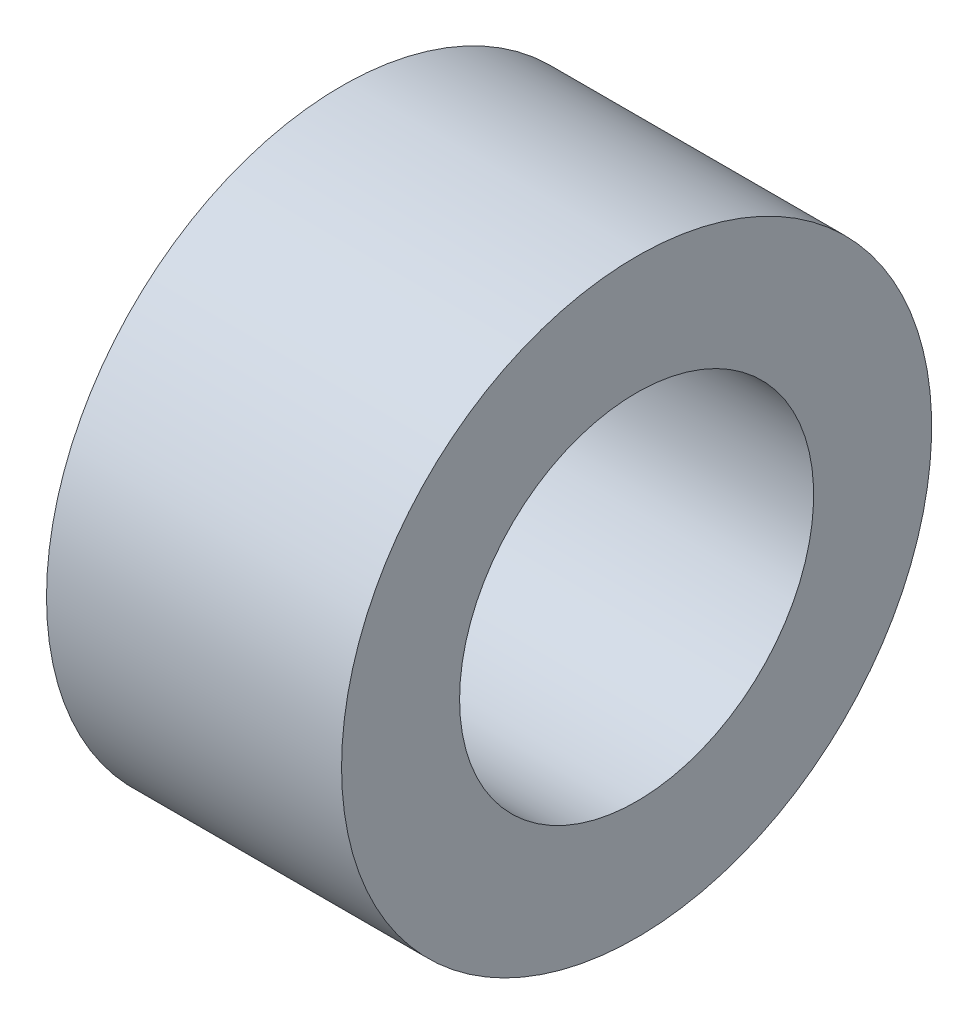
ISO-10303-21;
HEADER;
FILE_DESCRIPTION(('STEP AP214'),'2;1');
FILE_NAME('part.step','',(''),(''),'','','');
FILE_SCHEMA(('AUTOMOTIVE_DESIGN { 1 0 10303 214 1 1 1 1 }'));
ENDSEC;
DATA;
#1=APPLICATION_CONTEXT('core data for automotive mechanical design processes');
#2=APPLICATION_PROTOCOL_DEFINITION('international standard','automotive_design',2000,#1);
#3=PRODUCT_CONTEXT('',#1,'mechanical');
#4=PRODUCT('Part','Part','',(#3));
#5=PRODUCT_RELATED_PRODUCT_CATEGORY('part','',(#4));
#6=PRODUCT_DEFINITION_FORMATION('','',#4);
#7=PRODUCT_DEFINITION_CONTEXT('part definition',#1,'design');
#8=PRODUCT_DEFINITION('design','',#6,#7);
#9=PRODUCT_DEFINITION_SHAPE('','',#8);
#10=(LENGTH_UNIT() NAMED_UNIT(*) SI_UNIT(.MILLI.,.METRE.));
#11=(NAMED_UNIT(*) PLANE_ANGLE_UNIT() SI_UNIT($,.RADIAN.));
#12=(NAMED_UNIT(*) SI_UNIT($,.STERADIAN.) SOLID_ANGLE_UNIT());
#13=UNCERTAINTY_MEASURE_WITH_UNIT(LENGTH_MEASURE(1.E-05),#10,'distance_accuracy_value','');
#14=(GEOMETRIC_REPRESENTATION_CONTEXT(3) GLOBAL_UNCERTAINTY_ASSIGNED_CONTEXT((#13)) GLOBAL_UNIT_ASSIGNED_CONTEXT((#10,
#11,#12)) REPRESENTATION_CONTEXT('',''));
#15=CARTESIAN_POINT('',(0.,0.,0.));
#16=DIRECTION('',(0.,0.,1.));
#17=DIRECTION('',(1.,0.,0.));
#18=AXIS2_PLACEMENT_3D('',#15,#16,#17);
#19=CARTESIAN_POINT('',(-2.5,5.,0.));
#20=DIRECTION('',(1.,0.,0.));
#21=DIRECTION('',(0.,0.,-1.));
#22=AXIS2_PLACEMENT_3D('',#19,#20,#21);
#23=PLANE('',#22);
#24=CARTESIAN_POINT('',(-2.5,0.,0.));
#25=DIRECTION('',(-1.,0.,0.));
#26=DIRECTION('',(0.,0.,1.));
#27=AXIS2_PLACEMENT_3D('',#24,#25,#26);
#28=CIRCLE('',#27,3.);
#29=CARTESIAN_POINT('',(-2.5,0.,3.));
#30=VERTEX_POINT('',#29);
#31=EDGE_CURVE('E10',#30,#30,#28,.T.);
#32=ORIENTED_EDGE('',*,*,#31,.F.);
#33=EDGE_LOOP('',(#32));
#34=FACE_BOUND('',#33,.T.);
#35=CARTESIAN_POINT('',(-2.5,0.,0.));
#36=DIRECTION('',(-1.,0.,0.));
#37=DIRECTION('',(0.,0.,1.));
#38=AXIS2_PLACEMENT_3D('',#35,#36,#37);
#39=CIRCLE('',#38,5.);
#40=CARTESIAN_POINT('',(-2.5,0.,5.));
#41=VERTEX_POINT('',#40);
#42=EDGE_CURVE('E43',#41,#41,#39,.T.);
#43=ORIENTED_EDGE('',*,*,#42,.T.);
#44=EDGE_LOOP('',(#43));
#45=FACE_BOUND('',#44,.T.);
#46=ADVANCED_FACE('F29',(#34,#45),#23,.F.);
#47=CARTESIAN_POINT('',(-37.0031632185857,0.,0.));
#48=DIRECTION('',(-1.,0.,0.));
#49=DIRECTION('',(0.,0.,1.));
#50=AXIS2_PLACEMENT_3D('',#47,#48,#49);
#51=CYLINDRICAL_SURFACE('',#50,3.);
#52=CARTESIAN_POINT('',(2.5,0.,0.));
#53=DIRECTION('',(-1.,0.,0.));
#54=DIRECTION('',(0.,0.,1.));
#55=AXIS2_PLACEMENT_3D('',#52,#53,#54);
#56=CIRCLE('',#55,3.);
#57=CARTESIAN_POINT('',(2.5,0.,3.));
#58=VERTEX_POINT('',#57);
#59=EDGE_CURVE('E35',#58,#58,#56,.T.);
#60=ORIENTED_EDGE('',*,*,#59,.F.);
#61=EDGE_LOOP('',(#60));
#62=FACE_BOUND('',#61,.T.);
#63=ORIENTED_EDGE('',*,*,#31,.T.);
#64=EDGE_LOOP('',(#63));
#65=FACE_BOUND('',#64,.T.);
#66=ADVANCED_FACE('F58',(#62,#65),#51,.F.);
#67=CARTESIAN_POINT('',(2.5,5.,0.));
#68=DIRECTION('',(-1.,0.,0.));
#69=DIRECTION('',(0.,0.,1.));
#70=AXIS2_PLACEMENT_3D('',#67,#68,#69);
#71=PLANE('',#70);
#72=CARTESIAN_POINT('',(2.5,0.,0.));
#73=DIRECTION('',(-1.,0.,0.));
#74=DIRECTION('',(0.,0.,1.));
#75=AXIS2_PLACEMENT_3D('',#72,#73,#74);
#76=CIRCLE('',#75,5.);
#77=CARTESIAN_POINT('',(2.5,0.,5.));
#78=VERTEX_POINT('',#77);
#79=EDGE_CURVE('E39',#78,#78,#76,.T.);
#80=ORIENTED_EDGE('',*,*,#79,.F.);
#81=EDGE_LOOP('',(#80));
#82=FACE_BOUND('',#81,.T.);
#83=ORIENTED_EDGE('',*,*,#59,.T.);
#84=EDGE_LOOP('',(#83));
#85=FACE_BOUND('',#84,.T.);
#86=ADVANCED_FACE('F53',(#82,#85),#71,.F.);
#87=CARTESIAN_POINT('',(-37.0031632185857,0.,0.));
#88=DIRECTION('',(-1.,0.,0.));
#89=DIRECTION('',(0.,0.,1.));
#90=AXIS2_PLACEMENT_3D('',#87,#88,#89);
#91=CYLINDRICAL_SURFACE('',#90,5.);
#92=ORIENTED_EDGE('',*,*,#42,.F.);
#93=EDGE_LOOP('',(#92));
#94=FACE_BOUND('',#93,.T.);
#95=ORIENTED_EDGE('',*,*,#79,.T.);
#96=EDGE_LOOP('',(#95));
#97=FACE_BOUND('',#96,.T.);
#98=ADVANCED_FACE('F50',(#94,#97),#91,.T.);
#99=CLOSED_SHELL('',(#46,#66,#86,#98));
#100=MANIFOLD_SOLID_BREP('B2',#99);
#101=ADVANCED_BREP_SHAPE_REPRESENTATION('',(#18,#100),#14);
#102=SHAPE_DEFINITION_REPRESENTATION(#9,#101);
ENDSEC;
END-ISO-10303-21;
